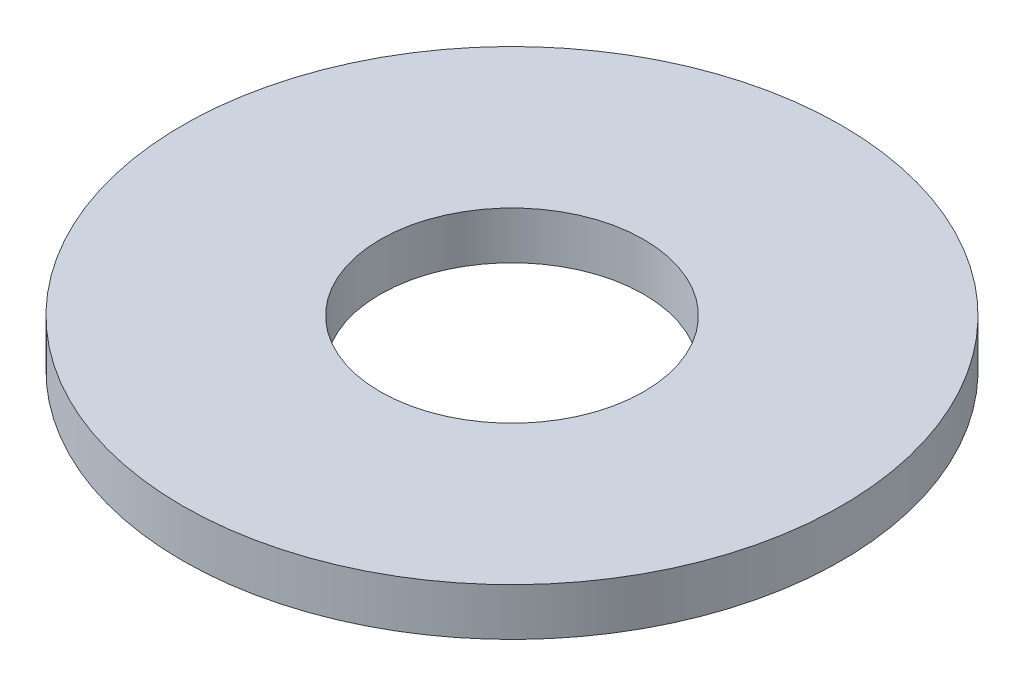
ISO-10303-21;
HEADER;
FILE_DESCRIPTION(('STEP AP214'),'2;1');
FILE_NAME('part.step','',(''),(''),'','','');
FILE_SCHEMA(('AUTOMOTIVE_DESIGN { 1 0 10303 214 1 1 1 1 }'));
ENDSEC;
DATA;
#1=APPLICATION_CONTEXT('core data for automotive mechanical design processes');
#2=APPLICATION_PROTOCOL_DEFINITION('international standard','automotive_design',2000,#1);
#3=PRODUCT_CONTEXT('',#1,'mechanical');
#4=PRODUCT('Part','Part','',(#3));
#5=PRODUCT_RELATED_PRODUCT_CATEGORY('part','',(#4));
#6=PRODUCT_DEFINITION_FORMATION('','',#4);
#7=PRODUCT_DEFINITION_CONTEXT('part definition',#1,'design');
#8=PRODUCT_DEFINITION('design','',#6,#7);
#9=PRODUCT_DEFINITION_SHAPE('','',#8);
#10=(LENGTH_UNIT() NAMED_UNIT(*) SI_UNIT(.MILLI.,.METRE.));
#11=(NAMED_UNIT(*) PLANE_ANGLE_UNIT() SI_UNIT($,.RADIAN.));
#12=(NAMED_UNIT(*) SI_UNIT($,.STERADIAN.) SOLID_ANGLE_UNIT());
#13=UNCERTAINTY_MEASURE_WITH_UNIT(LENGTH_MEASURE(1.E-05),#10,'distance_accuracy_value','');
#14=(GEOMETRIC_REPRESENTATION_CONTEXT(3) GLOBAL_UNCERTAINTY_ASSIGNED_CONTEXT((#13)) GLOBAL_UNIT_ASSIGNED_CONTEXT((#10,
#11,#12)) REPRESENTATION_CONTEXT('',''));
#15=CARTESIAN_POINT('',(0.,0.,0.));
#16=DIRECTION('',(0.,0.,1.));
#17=DIRECTION('',(1.,0.,0.));
#18=AXIS2_PLACEMENT_3D('',#15,#16,#17);
#19=CARTESIAN_POINT('',(0.,9.,0.));
#20=DIRECTION('',(0.,-1.,0.));
#21=DIRECTION('',(0.,0.,-1.));
#22=AXIS2_PLACEMENT_3D('',#19,#20,#21);
#23=CYLINDRICAL_SURFACE('',#22,62.5);
#24=CARTESIAN_POINT('',(0.,9.,0.));
#25=DIRECTION('',(0.,1.,0.));
#26=DIRECTION('',(0.,0.,1.));
#27=AXIS2_PLACEMENT_3D('',#24,#25,#26);
#28=CIRCLE('',#27,62.5);
#29=CARTESIAN_POINT('',(0.,9.,62.5));
#30=VERTEX_POINT('',#29);
#31=EDGE_CURVE('E10',#30,#30,#28,.T.);
#32=ORIENTED_EDGE('',*,*,#31,.F.);
#33=EDGE_LOOP('',(#32));
#34=FACE_BOUND('',#33,.T.);
#35=CARTESIAN_POINT('',(0.,0.,0.));
#36=DIRECTION('',(0.,1.,0.));
#37=DIRECTION('',(0.,0.,1.));
#38=AXIS2_PLACEMENT_3D('',#35,#36,#37);
#39=CIRCLE('',#38,62.5);
#40=CARTESIAN_POINT('',(0.,0.,62.5));
#41=VERTEX_POINT('',#40);
#42=EDGE_CURVE('E37',#41,#41,#39,.T.);
#43=ORIENTED_EDGE('',*,*,#42,.T.);
#44=EDGE_LOOP('',(#43));
#45=FACE_BOUND('',#44,.T.);
#46=ADVANCED_FACE('F40',(#34,#45),#23,.T.);
#47=CARTESIAN_POINT('',(0.,9.,0.));
#48=DIRECTION('',(0.,1.,0.));
#49=DIRECTION('',(0.,0.,1.));
#50=AXIS2_PLACEMENT_3D('',#47,#48,#49);
#51=PLANE('',#50);
#52=CARTESIAN_POINT('',(0.,9.,0.));
#53=DIRECTION('',(0.,1.,0.));
#54=DIRECTION('',(0.,0.,1.));
#55=AXIS2_PLACEMENT_3D('',#52,#53,#54);
#56=CIRCLE('',#55,25.);
#57=CARTESIAN_POINT('',(0.,9.,25.));
#58=VERTEX_POINT('',#57);
#59=EDGE_CURVE('E50',#58,#58,#56,.T.);
#60=ORIENTED_EDGE('',*,*,#59,.F.);
#61=EDGE_LOOP('',(#60));
#62=FACE_BOUND('',#61,.T.);
#63=ORIENTED_EDGE('',*,*,#31,.T.);
#64=EDGE_LOOP('',(#63));
#65=FACE_BOUND('',#64,.T.);
#66=ADVANCED_FACE('F59',(#62,#65),#51,.T.);
#67=CARTESIAN_POINT('',(0.,0.,0.));
#68=DIRECTION('',(0.,1.,0.));
#69=DIRECTION('',(0.,0.,1.));
#70=AXIS2_PLACEMENT_3D('',#67,#68,#69);
#71=PLANE('',#70);
#72=CARTESIAN_POINT('',(0.,0.,0.));
#73=DIRECTION('',(0.,1.,0.));
#74=DIRECTION('',(0.,0.,1.));
#75=AXIS2_PLACEMENT_3D('',#72,#73,#74);
#76=CIRCLE('',#75,25.);
#77=CARTESIAN_POINT('',(0.,0.,25.));
#78=VERTEX_POINT('',#77);
#79=EDGE_CURVE('E47',#78,#78,#76,.T.);
#80=ORIENTED_EDGE('',*,*,#79,.T.);
#81=EDGE_LOOP('',(#80));
#82=FACE_BOUND('',#81,.T.);
#83=ORIENTED_EDGE('',*,*,#42,.F.);
#84=EDGE_LOOP('',(#83));
#85=FACE_BOUND('',#84,.T.);
#86=ADVANCED_FACE('F58',(#82,#85),#71,.F.);
#87=CARTESIAN_POINT('',(0.,9.,0.));
#88=DIRECTION('',(0.,-1.,0.));
#89=DIRECTION('',(0.,0.,-1.));
#90=AXIS2_PLACEMENT_3D('',#87,#88,#89);
#91=CYLINDRICAL_SURFACE('',#90,25.);
#92=ORIENTED_EDGE('',*,*,#59,.T.);
#93=EDGE_LOOP('',(#92));
#94=FACE_BOUND('',#93,.T.);
#95=ORIENTED_EDGE('',*,*,#79,.F.);
#96=EDGE_LOOP('',(#95));
#97=FACE_BOUND('',#96,.T.);
#98=ADVANCED_FACE('F54',(#94,#97),#91,.F.);
#99=CLOSED_SHELL('',(#46,#66,#86,#98));
#100=MANIFOLD_SOLID_BREP('B2',#99);
#101=ADVANCED_BREP_SHAPE_REPRESENTATION('',(#18,#100),#14);
#102=SHAPE_DEFINITION_REPRESENTATION(#9,#101);
ENDSEC;
END-ISO-10303-21;
